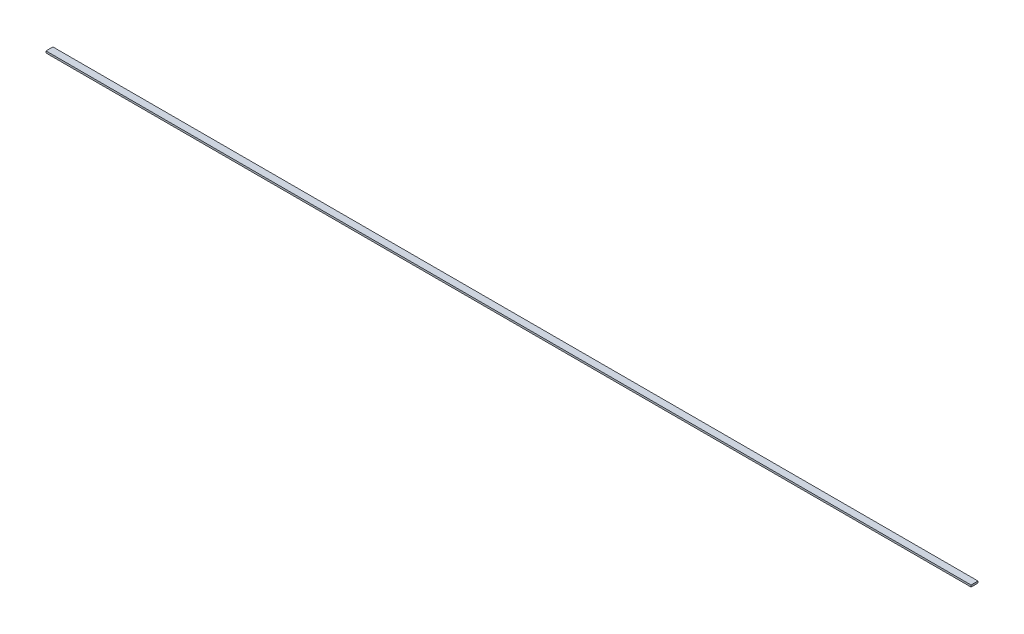
ISO-10303-21;
HEADER;
FILE_DESCRIPTION(('STEP AP214'),'2;1');
FILE_NAME('part.step','',(''),(''),'','','');
FILE_SCHEMA(('AUTOMOTIVE_DESIGN { 1 0 10303 214 1 1 1 1 }'));
ENDSEC;
DATA;
#1=APPLICATION_CONTEXT('core data for automotive mechanical design processes');
#2=APPLICATION_PROTOCOL_DEFINITION('international standard','automotive_design',2000,#1);
#3=PRODUCT_CONTEXT('',#1,'mechanical');
#4=PRODUCT('Part','Part','',(#3));
#5=PRODUCT_RELATED_PRODUCT_CATEGORY('part','',(#4));
#6=PRODUCT_DEFINITION_FORMATION('','',#4);
#7=PRODUCT_DEFINITION_CONTEXT('part definition',#1,'design');
#8=PRODUCT_DEFINITION('design','',#6,#7);
#9=PRODUCT_DEFINITION_SHAPE('','',#8);
#10=(LENGTH_UNIT() NAMED_UNIT(*) SI_UNIT(.MILLI.,.METRE.));
#11=(NAMED_UNIT(*) PLANE_ANGLE_UNIT() SI_UNIT($,.RADIAN.));
#12=(NAMED_UNIT(*) SI_UNIT($,.STERADIAN.) SOLID_ANGLE_UNIT());
#13=UNCERTAINTY_MEASURE_WITH_UNIT(LENGTH_MEASURE(1.E-05),#10,'distance_accuracy_value','');
#14=(GEOMETRIC_REPRESENTATION_CONTEXT(3) GLOBAL_UNCERTAINTY_ASSIGNED_CONTEXT((#13)) GLOBAL_UNIT_ASSIGNED_CONTEXT((#10,
#11,#12)) REPRESENTATION_CONTEXT('',''));
#15=CARTESIAN_POINT('',(0.,0.,0.));
#16=DIRECTION('',(0.,0.,1.));
#17=DIRECTION('',(1.,0.,0.));
#18=AXIS2_PLACEMENT_3D('',#15,#16,#17);
#19=CARTESIAN_POINT('',(-275.,0.545,4.125));
#20=DIRECTION('',(-1.,0.,0.));
#21=DIRECTION('',(0.,0.,1.));
#22=AXIS2_PLACEMENT_3D('',#19,#20,#21);
#23=PLANE('',#22);
#24=DIRECTION('',(0.,0.,-1.));
#25=VECTOR('',#24,1.);
#26=CARTESIAN_POINT('',(-275.,-0.545,4.125));
#27=LINE('',#26,#25);
#28=CARTESIAN_POINT('',(-275.,-0.545,4.125));
#29=VERTEX_POINT('',#28);
#30=CARTESIAN_POINT('',(-275.,-0.545,0.));
#31=VERTEX_POINT('',#30);
#32=EDGE_CURVE('E103',#29,#31,#27,.T.);
#33=ORIENTED_EDGE('',*,*,#32,.F.);
#34=DIRECTION('',(0.,-1.,0.));
#35=VECTOR('',#34,1.);
#36=CARTESIAN_POINT('',(-275.,0.545,4.125));
#37=LINE('',#36,#35);
#38=CARTESIAN_POINT('',(-275.,0.545,4.125));
#39=VERTEX_POINT('',#38);
#40=EDGE_CURVE('E11',#39,#29,#37,.T.);
#41=ORIENTED_EDGE('',*,*,#40,.F.);
#42=DIRECTION('',(0.,0.,-1.));
#43=VECTOR('',#42,1.);
#44=CARTESIAN_POINT('',(-275.,0.545,4.125));
#45=LINE('',#44,#43);
#46=CARTESIAN_POINT('',(-275.,0.545,0.));
#47=VERTEX_POINT('',#46);
#48=EDGE_CURVE('E97',#39,#47,#45,.T.);
#49=ORIENTED_EDGE('',*,*,#48,.T.);
#50=DIRECTION('',(0.,-1.,0.));
#51=VECTOR('',#50,1.);
#52=CARTESIAN_POINT('',(-275.,0.545,0.));
#53=LINE('',#52,#51);
#54=EDGE_CURVE('E42',#47,#31,#53,.T.);
#55=ORIENTED_EDGE('',*,*,#54,.T.);
#56=EDGE_LOOP('',(#33,#41,#49,#55));
#57=FACE_BOUND('',#56,.T.);
#58=ADVANCED_FACE('F39',(#57),#23,.T.);
#59=CARTESIAN_POINT('',(275.,0.545,4.125));
#60=DIRECTION('',(0.,0.,1.));
#61=DIRECTION('',(1.,0.,0.));
#62=AXIS2_PLACEMENT_3D('',#59,#60,#61);
#63=PLANE('',#62);
#64=DIRECTION('',(-1.,0.,0.));
#65=VECTOR('',#64,1.);
#66=CARTESIAN_POINT('',(275.,-0.545,4.125));
#67=LINE('',#66,#65);
#68=CARTESIAN_POINT('',(275.,-0.545,4.125));
#69=VERTEX_POINT('',#68);
#70=EDGE_CURVE('E99',#69,#29,#67,.T.);
#71=ORIENTED_EDGE('',*,*,#70,.F.);
#72=DIRECTION('',(0.,-1.,0.));
#73=VECTOR('',#72,1.);
#74=CARTESIAN_POINT('',(275.,0.545,4.125));
#75=LINE('',#74,#73);
#76=CARTESIAN_POINT('',(275.,0.545,4.125));
#77=VERTEX_POINT('',#76);
#78=EDGE_CURVE('E48',#77,#69,#75,.T.);
#79=ORIENTED_EDGE('',*,*,#78,.F.);
#80=DIRECTION('',(-1.,0.,0.));
#81=VECTOR('',#80,1.);
#82=CARTESIAN_POINT('',(275.,0.545,4.125));
#83=LINE('',#82,#81);
#84=EDGE_CURVE('E94',#77,#39,#83,.T.);
#85=ORIENTED_EDGE('',*,*,#84,.T.);
#86=ORIENTED_EDGE('',*,*,#40,.T.);
#87=EDGE_LOOP('',(#71,#79,#85,#86));
#88=FACE_BOUND('',#87,.T.);
#89=ADVANCED_FACE('F113',(#88),#63,.T.);
#90=CARTESIAN_POINT('',(275.,0.545,0.));
#91=DIRECTION('',(1.,0.,0.));
#92=DIRECTION('',(0.,0.,-1.));
#93=AXIS2_PLACEMENT_3D('',#90,#91,#92);
#94=PLANE('',#93);
#95=DIRECTION('',(0.,0.,1.));
#96=VECTOR('',#95,1.);
#97=CARTESIAN_POINT('',(275.,-0.545,0.));
#98=LINE('',#97,#96);
#99=CARTESIAN_POINT('',(275.,-0.545,0.));
#100=VERTEX_POINT('',#99);
#101=EDGE_CURVE('E89',#100,#69,#98,.T.);
#102=ORIENTED_EDGE('',*,*,#101,.F.);
#103=DIRECTION('',(0.,-1.,0.));
#104=VECTOR('',#103,1.);
#105=CARTESIAN_POINT('',(275.,0.545,0.));
#106=LINE('',#105,#104);
#107=CARTESIAN_POINT('',(275.,0.545,0.));
#108=VERTEX_POINT('',#107);
#109=EDGE_CURVE('E84',#108,#100,#106,.T.);
#110=ORIENTED_EDGE('',*,*,#109,.F.);
#111=DIRECTION('',(0.,0.,1.));
#112=VECTOR('',#111,1.);
#113=CARTESIAN_POINT('',(275.,0.545,0.));
#114=LINE('',#113,#112);
#115=EDGE_CURVE('E87',#108,#77,#114,.T.);
#116=ORIENTED_EDGE('',*,*,#115,.T.);
#117=ORIENTED_EDGE('',*,*,#78,.T.);
#118=EDGE_LOOP('',(#102,#110,#116,#117));
#119=FACE_BOUND('',#118,.T.);
#120=ADVANCED_FACE('F86',(#119),#94,.T.);
#121=CARTESIAN_POINT('',(-275.,0.545,0.));
#122=DIRECTION('',(0.,0.,-1.));
#123=DIRECTION('',(-1.,0.,0.));
#124=AXIS2_PLACEMENT_3D('',#121,#122,#123);
#125=PLANE('',#124);
#126=DIRECTION('',(1.,0.,0.));
#127=VECTOR('',#126,1.);
#128=CARTESIAN_POINT('',(-275.,-0.545,0.));
#129=LINE('',#128,#127);
#130=EDGE_CURVE('E106',#31,#100,#129,.T.);
#131=ORIENTED_EDGE('',*,*,#130,.F.);
#132=ORIENTED_EDGE('',*,*,#54,.F.);
#133=DIRECTION('',(1.,0.,0.));
#134=VECTOR('',#133,1.);
#135=CARTESIAN_POINT('',(-275.,0.545,0.));
#136=LINE('',#135,#134);
#137=EDGE_CURVE('E93',#47,#108,#136,.T.);
#138=ORIENTED_EDGE('',*,*,#137,.T.);
#139=ORIENTED_EDGE('',*,*,#109,.T.);
#140=EDGE_LOOP('',(#131,#132,#138,#139));
#141=FACE_BOUND('',#140,.T.);
#142=ADVANCED_FACE('F96',(#141),#125,.T.);
#143=CARTESIAN_POINT('',(0.,0.545,0.));
#144=DIRECTION('',(0.,-1.,0.));
#145=DIRECTION('',(0.,0.,-1.));
#146=AXIS2_PLACEMENT_3D('',#143,#144,#145);
#147=PLANE('',#146);
#148=ORIENTED_EDGE('',*,*,#48,.F.);
#149=ORIENTED_EDGE('',*,*,#84,.F.);
#150=ORIENTED_EDGE('',*,*,#115,.F.);
#151=ORIENTED_EDGE('',*,*,#137,.F.);
#152=EDGE_LOOP('',(#148,#149,#150,#151));
#153=FACE_BOUND('',#152,.T.);
#154=ADVANCED_FACE('F92',(#153),#147,.F.);
#155=CARTESIAN_POINT('',(0.,-0.545,0.));
#156=DIRECTION('',(0.,-1.,0.));
#157=DIRECTION('',(0.,0.,-1.));
#158=AXIS2_PLACEMENT_3D('',#155,#156,#157);
#159=PLANE('',#158);
#160=ORIENTED_EDGE('',*,*,#32,.T.);
#161=ORIENTED_EDGE('',*,*,#130,.T.);
#162=ORIENTED_EDGE('',*,*,#101,.T.);
#163=ORIENTED_EDGE('',*,*,#70,.T.);
#164=EDGE_LOOP('',(#160,#161,#162,#163));
#165=FACE_BOUND('',#164,.T.);
#166=ADVANCED_FACE('F112',(#165),#159,.T.);
#167=CLOSED_SHELL('',(#58,#89,#120,#142,#154,#166));
#168=MANIFOLD_SOLID_BREP('B2',#167);
#169=ADVANCED_BREP_SHAPE_REPRESENTATION('',(#18,#168),#14);
#170=SHAPE_DEFINITION_REPRESENTATION(#9,#169);
ENDSEC;
END-ISO-10303-21;
